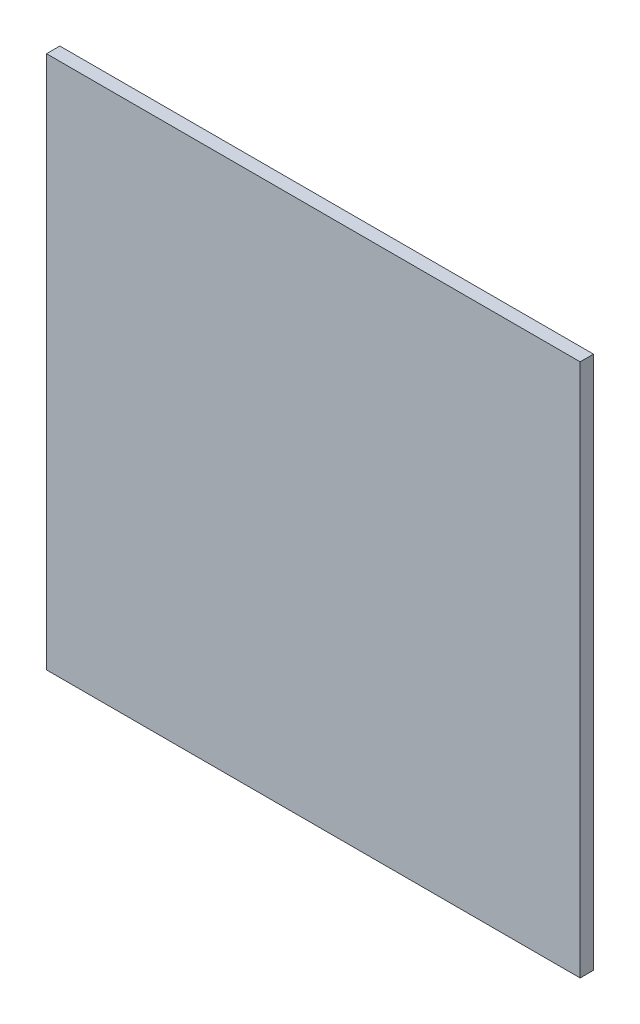
ISO-10303-21;
HEADER;
FILE_DESCRIPTION(('STEP AP214'),'2;1');
FILE_NAME('part.step','',(''),(''),'','','');
FILE_SCHEMA(('AUTOMOTIVE_DESIGN { 1 0 10303 214 1 1 1 1 }'));
ENDSEC;
DATA;
#1=APPLICATION_CONTEXT('core data for automotive mechanical design processes');
#2=APPLICATION_PROTOCOL_DEFINITION('international standard','automotive_design',2000,#1);
#3=PRODUCT_CONTEXT('',#1,'mechanical');
#4=PRODUCT('Part','Part','',(#3));
#5=PRODUCT_RELATED_PRODUCT_CATEGORY('part','',(#4));
#6=PRODUCT_DEFINITION_FORMATION('','',#4);
#7=PRODUCT_DEFINITION_CONTEXT('part definition',#1,'design');
#8=PRODUCT_DEFINITION('design','',#6,#7);
#9=PRODUCT_DEFINITION_SHAPE('','',#8);
#10=(LENGTH_UNIT() NAMED_UNIT(*) SI_UNIT(.MILLI.,.METRE.));
#11=(NAMED_UNIT(*) PLANE_ANGLE_UNIT() SI_UNIT($,.RADIAN.));
#12=(NAMED_UNIT(*) SI_UNIT($,.STERADIAN.) SOLID_ANGLE_UNIT());
#13=UNCERTAINTY_MEASURE_WITH_UNIT(LENGTH_MEASURE(1.E-05),#10,'distance_accuracy_value','');
#14=(GEOMETRIC_REPRESENTATION_CONTEXT(3) GLOBAL_UNCERTAINTY_ASSIGNED_CONTEXT((#13)) GLOBAL_UNIT_ASSIGNED_CONTEXT((#10,
#11,#12)) REPRESENTATION_CONTEXT('',''));
#15=CARTESIAN_POINT('',(0.,0.,0.));
#16=DIRECTION('',(0.,0.,1.));
#17=DIRECTION('',(1.,0.,0.));
#18=AXIS2_PLACEMENT_3D('',#15,#16,#17);
#19=CARTESIAN_POINT('',(-81.3088447053612,12.9222972972973,10.));
#20=DIRECTION('',(1.,0.,0.));
#21=DIRECTION('',(0.,1.,0.));
#22=AXIS2_PLACEMENT_3D('',#19,#20,#21);
#23=PLANE('',#22);
#24=DIRECTION('',(0.,-1.,0.));
#25=VECTOR('',#24,1.);
#26=CARTESIAN_POINT('',(-81.3088447053612,12.9222972972973,0.));
#27=LINE('',#26,#25);
#28=CARTESIAN_POINT('',(-81.3088447053612,12.9222972972973,0.));
#29=VERTEX_POINT('',#28);
#30=CARTESIAN_POINT('',(-81.3088447053611,-387.077702702703,0.));
#31=VERTEX_POINT('',#30);
#32=EDGE_CURVE('E96',#29,#31,#27,.T.);
#33=ORIENTED_EDGE('',*,*,#32,.T.);
#34=DIRECTION('',(0.,0.,-1.));
#35=VECTOR('',#34,1.);
#36=CARTESIAN_POINT('',(-81.3088447053611,-387.077702702703,10.));
#37=LINE('',#36,#35);
#38=CARTESIAN_POINT('',(-81.3088447053611,-387.077702702703,10.));
#39=VERTEX_POINT('',#38);
#40=EDGE_CURVE('E11',#39,#31,#37,.T.);
#41=ORIENTED_EDGE('',*,*,#40,.F.);
#42=DIRECTION('',(0.,-1.,0.));
#43=VECTOR('',#42,1.);
#44=CARTESIAN_POINT('',(-81.3088447053612,12.9222972972973,10.));
#45=LINE('',#44,#43);
#46=CARTESIAN_POINT('',(-81.3088447053612,12.9222972972973,10.));
#47=VERTEX_POINT('',#46);
#48=EDGE_CURVE('E84',#47,#39,#45,.T.);
#49=ORIENTED_EDGE('',*,*,#48,.F.);
#50=DIRECTION('',(0.,0.,-1.));
#51=VECTOR('',#50,1.);
#52=CARTESIAN_POINT('',(-81.3088447053612,12.9222972972973,10.));
#53=LINE('',#52,#51);
#54=EDGE_CURVE('E92',#47,#29,#53,.T.);
#55=ORIENTED_EDGE('',*,*,#54,.T.);
#56=EDGE_LOOP('',(#33,#41,#49,#55));
#57=FACE_BOUND('',#56,.T.);
#58=ADVANCED_FACE('F33',(#57),#23,.F.);
#59=CARTESIAN_POINT('',(-81.3088447053611,-387.077702702703,10.));
#60=DIRECTION('',(0.,1.,0.));
#61=DIRECTION('',(0.,0.,1.));
#62=AXIS2_PLACEMENT_3D('',#59,#60,#61);
#63=PLANE('',#62);
#64=DIRECTION('',(1.,0.,0.));
#65=VECTOR('',#64,1.);
#66=CARTESIAN_POINT('',(-81.3088447053611,-387.077702702703,0.));
#67=LINE('',#66,#65);
#68=CARTESIAN_POINT('',(318.691155294639,-387.077702702703,0.));
#69=VERTEX_POINT('',#68);
#70=EDGE_CURVE('E88',#31,#69,#67,.T.);
#71=ORIENTED_EDGE('',*,*,#70,.T.);
#72=DIRECTION('',(0.,0.,-1.));
#73=VECTOR('',#72,1.);
#74=CARTESIAN_POINT('',(318.691155294639,-387.077702702703,10.));
#75=LINE('',#74,#73);
#76=CARTESIAN_POINT('',(318.691155294639,-387.077702702703,10.));
#77=VERTEX_POINT('',#76);
#78=EDGE_CURVE('E41',#77,#69,#75,.T.);
#79=ORIENTED_EDGE('',*,*,#78,.F.);
#80=DIRECTION('',(1.,0.,0.));
#81=VECTOR('',#80,1.);
#82=CARTESIAN_POINT('',(-81.3088447053611,-387.077702702703,10.));
#83=LINE('',#82,#81);
#84=EDGE_CURVE('E79',#39,#77,#83,.T.);
#85=ORIENTED_EDGE('',*,*,#84,.F.);
#86=ORIENTED_EDGE('',*,*,#40,.T.);
#87=EDGE_LOOP('',(#71,#79,#85,#86));
#88=FACE_BOUND('',#87,.T.);
#89=ADVANCED_FACE('F87',(#88),#63,.F.);
#90=CARTESIAN_POINT('',(318.691155294639,12.9222972972973,10.));
#91=DIRECTION('',(-1.,0.,0.));
#92=DIRECTION('',(0.,-1.,0.));
#93=AXIS2_PLACEMENT_3D('',#90,#91,#92);
#94=PLANE('',#93);
#95=DIRECTION('',(0.,1.,0.));
#96=VECTOR('',#95,1.);
#97=CARTESIAN_POINT('',(318.691155294639,12.9222972972973,0.));
#98=LINE('',#97,#96);
#99=CARTESIAN_POINT('',(318.691155294639,12.9222972972973,0.));
#100=VERTEX_POINT('',#99);
#101=EDGE_CURVE('E66',#69,#100,#98,.T.);
#102=ORIENTED_EDGE('',*,*,#101,.T.);
#103=DIRECTION('',(0.,0.,-1.));
#104=VECTOR('',#103,1.);
#105=CARTESIAN_POINT('',(318.691155294639,12.9222972972973,10.));
#106=LINE('',#105,#104);
#107=CARTESIAN_POINT('',(318.691155294639,12.9222972972973,10.));
#108=VERTEX_POINT('',#107);
#109=EDGE_CURVE('E89',#108,#100,#106,.T.);
#110=ORIENTED_EDGE('',*,*,#109,.F.);
#111=DIRECTION('',(0.,1.,0.));
#112=VECTOR('',#111,1.);
#113=CARTESIAN_POINT('',(318.691155294639,12.9222972972973,10.));
#114=LINE('',#113,#112);
#115=EDGE_CURVE('E82',#77,#108,#114,.T.);
#116=ORIENTED_EDGE('',*,*,#115,.F.);
#117=ORIENTED_EDGE('',*,*,#78,.T.);
#118=EDGE_LOOP('',(#102,#110,#116,#117));
#119=FACE_BOUND('',#118,.T.);
#120=ADVANCED_FACE('F90',(#119),#94,.F.);
#121=CARTESIAN_POINT('',(-81.3088447053612,12.9222972972973,10.));
#122=DIRECTION('',(0.,-1.,0.));
#123=DIRECTION('',(0.,0.,-1.));
#124=AXIS2_PLACEMENT_3D('',#121,#122,#123);
#125=PLANE('',#124);
#126=DIRECTION('',(-1.,0.,0.));
#127=VECTOR('',#126,1.);
#128=CARTESIAN_POINT('',(-81.3088447053612,12.9222972972973,0.));
#129=LINE('',#128,#127);
#130=EDGE_CURVE('E72',#100,#29,#129,.T.);
#131=ORIENTED_EDGE('',*,*,#130,.T.);
#132=ORIENTED_EDGE('',*,*,#54,.F.);
#133=DIRECTION('',(-1.,0.,0.));
#134=VECTOR('',#133,1.);
#135=CARTESIAN_POINT('',(-81.3088447053612,12.9222972972973,10.));
#136=LINE('',#135,#134);
#137=EDGE_CURVE('E49',#108,#47,#136,.T.);
#138=ORIENTED_EDGE('',*,*,#137,.F.);
#139=ORIENTED_EDGE('',*,*,#109,.T.);
#140=EDGE_LOOP('',(#131,#132,#138,#139));
#141=FACE_BOUND('',#140,.T.);
#142=ADVANCED_FACE('F103',(#141),#125,.F.);
#143=CARTESIAN_POINT('',(0.,0.,10.));
#144=DIRECTION('',(0.,0.,1.));
#145=DIRECTION('',(1.,0.,0.));
#146=AXIS2_PLACEMENT_3D('',#143,#144,#145);
#147=PLANE('',#146);
#148=ORIENTED_EDGE('',*,*,#48,.T.);
#149=ORIENTED_EDGE('',*,*,#84,.T.);
#150=ORIENTED_EDGE('',*,*,#115,.T.);
#151=ORIENTED_EDGE('',*,*,#137,.T.);
#152=EDGE_LOOP('',(#148,#149,#150,#151));
#153=FACE_BOUND('',#152,.T.);
#154=ADVANCED_FACE('F80',(#153),#147,.T.);
#155=CARTESIAN_POINT('',(0.,0.,0.));
#156=DIRECTION('',(0.,0.,1.));
#157=DIRECTION('',(1.,0.,0.));
#158=AXIS2_PLACEMENT_3D('',#155,#156,#157);
#159=PLANE('',#158);
#160=ORIENTED_EDGE('',*,*,#32,.F.);
#161=ORIENTED_EDGE('',*,*,#130,.F.);
#162=ORIENTED_EDGE('',*,*,#101,.F.);
#163=ORIENTED_EDGE('',*,*,#70,.F.);
#164=EDGE_LOOP('',(#160,#161,#162,#163));
#165=FACE_BOUND('',#164,.T.);
#166=ADVANCED_FACE('F106',(#165),#159,.F.);
#167=CLOSED_SHELL('',(#58,#89,#120,#142,#154,#166));
#168=MANIFOLD_SOLID_BREP('B2',#167);
#169=ADVANCED_BREP_SHAPE_REPRESENTATION('',(#18,#168),#14);
#170=SHAPE_DEFINITION_REPRESENTATION(#9,#169);
ENDSEC;
END-ISO-10303-21;
